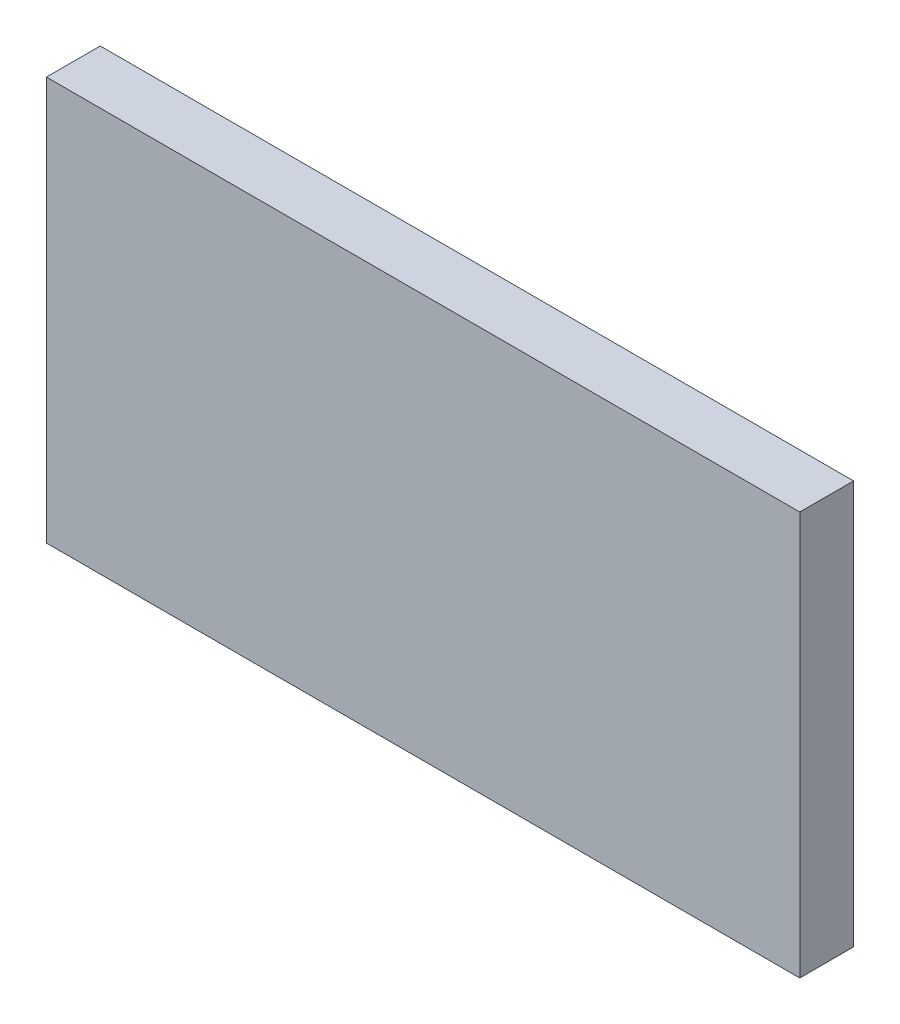
ISO-10303-21;
HEADER;
FILE_DESCRIPTION(('STEP AP214'),'2;1');
FILE_NAME('part.step','',(''),(''),'','','');
FILE_SCHEMA(('AUTOMOTIVE_DESIGN { 1 0 10303 214 1 1 1 1 }'));
ENDSEC;
DATA;
#1=APPLICATION_CONTEXT('core data for automotive mechanical design processes');
#2=APPLICATION_PROTOCOL_DEFINITION('international standard','automotive_design',2000,#1);
#3=PRODUCT_CONTEXT('',#1,'mechanical');
#4=PRODUCT('Part','Part','',(#3));
#5=PRODUCT_RELATED_PRODUCT_CATEGORY('part','',(#4));
#6=PRODUCT_DEFINITION_FORMATION('','',#4);
#7=PRODUCT_DEFINITION_CONTEXT('part definition',#1,'design');
#8=PRODUCT_DEFINITION('design','',#6,#7);
#9=PRODUCT_DEFINITION_SHAPE('','',#8);
#10=(LENGTH_UNIT() NAMED_UNIT(*) SI_UNIT(.MILLI.,.METRE.));
#11=(NAMED_UNIT(*) PLANE_ANGLE_UNIT() SI_UNIT($,.RADIAN.));
#12=(NAMED_UNIT(*) SI_UNIT($,.STERADIAN.) SOLID_ANGLE_UNIT());
#13=UNCERTAINTY_MEASURE_WITH_UNIT(LENGTH_MEASURE(1.E-05),#10,'distance_accuracy_value','');
#14=(GEOMETRIC_REPRESENTATION_CONTEXT(3) GLOBAL_UNCERTAINTY_ASSIGNED_CONTEXT((#13)) GLOBAL_UNIT_ASSIGNED_CONTEXT((#10,
#11,#12)) REPRESENTATION_CONTEXT('',''));
#15=CARTESIAN_POINT('',(0.,0.,0.));
#16=DIRECTION('',(0.,0.,1.));
#17=DIRECTION('',(1.,0.,0.));
#18=AXIS2_PLACEMENT_3D('',#15,#16,#17);
#19=CARTESIAN_POINT('',(-166.584362139918,89.7478991596639,20.));
#20=DIRECTION('',(1.,0.,0.));
#21=DIRECTION('',(0.,1.,0.));
#22=AXIS2_PLACEMENT_3D('',#19,#20,#21);
#23=PLANE('',#22);
#24=DIRECTION('',(0.,-1.,0.));
#25=VECTOR('',#24,1.);
#26=CARTESIAN_POINT('',(-166.584362139918,89.7478991596639,0.));
#27=LINE('',#26,#25);
#28=CARTESIAN_POINT('',(-166.584362139918,89.7478991596639,0.));
#29=VERTEX_POINT('',#28);
#30=CARTESIAN_POINT('',(-166.584362139918,-60.2521008403361,0.));
#31=VERTEX_POINT('',#30);
#32=EDGE_CURVE('E96',#29,#31,#27,.T.);
#33=ORIENTED_EDGE('',*,*,#32,.T.);
#34=DIRECTION('',(0.,0.,-1.));
#35=VECTOR('',#34,1.);
#36=CARTESIAN_POINT('',(-166.584362139918,-60.2521008403361,20.));
#37=LINE('',#36,#35);
#38=CARTESIAN_POINT('',(-166.584362139918,-60.2521008403361,20.));
#39=VERTEX_POINT('',#38);
#40=EDGE_CURVE('E11',#39,#31,#37,.T.);
#41=ORIENTED_EDGE('',*,*,#40,.F.);
#42=DIRECTION('',(0.,-1.,0.));
#43=VECTOR('',#42,1.);
#44=CARTESIAN_POINT('',(-166.584362139918,89.7478991596639,20.));
#45=LINE('',#44,#43);
#46=CARTESIAN_POINT('',(-166.584362139918,89.7478991596639,20.));
#47=VERTEX_POINT('',#46);
#48=EDGE_CURVE('E84',#47,#39,#45,.T.);
#49=ORIENTED_EDGE('',*,*,#48,.F.);
#50=DIRECTION('',(0.,0.,-1.));
#51=VECTOR('',#50,1.);
#52=CARTESIAN_POINT('',(-166.584362139918,89.7478991596639,20.));
#53=LINE('',#52,#51);
#54=EDGE_CURVE('E92',#47,#29,#53,.T.);
#55=ORIENTED_EDGE('',*,*,#54,.T.);
#56=EDGE_LOOP('',(#33,#41,#49,#55));
#57=FACE_BOUND('',#56,.T.);
#58=ADVANCED_FACE('F33',(#57),#23,.F.);
#59=CARTESIAN_POINT('',(-166.584362139918,-60.2521008403361,20.));
#60=DIRECTION('',(0.,1.,0.));
#61=DIRECTION('',(0.,0.,1.));
#62=AXIS2_PLACEMENT_3D('',#59,#60,#61);
#63=PLANE('',#62);
#64=DIRECTION('',(1.,0.,0.));
#65=VECTOR('',#64,1.);
#66=CARTESIAN_POINT('',(-166.584362139918,-60.2521008403361,0.));
#67=LINE('',#66,#65);
#68=CARTESIAN_POINT('',(113.415637860082,-60.2521008403361,0.));
#69=VERTEX_POINT('',#68);
#70=EDGE_CURVE('E88',#31,#69,#67,.T.);
#71=ORIENTED_EDGE('',*,*,#70,.T.);
#72=DIRECTION('',(0.,0.,-1.));
#73=VECTOR('',#72,1.);
#74=CARTESIAN_POINT('',(113.415637860082,-60.2521008403361,20.));
#75=LINE('',#74,#73);
#76=CARTESIAN_POINT('',(113.415637860082,-60.2521008403361,20.));
#77=VERTEX_POINT('',#76);
#78=EDGE_CURVE('E41',#77,#69,#75,.T.);
#79=ORIENTED_EDGE('',*,*,#78,.F.);
#80=DIRECTION('',(1.,0.,0.));
#81=VECTOR('',#80,1.);
#82=CARTESIAN_POINT('',(-166.584362139918,-60.2521008403361,20.));
#83=LINE('',#82,#81);
#84=EDGE_CURVE('E79',#39,#77,#83,.T.);
#85=ORIENTED_EDGE('',*,*,#84,.F.);
#86=ORIENTED_EDGE('',*,*,#40,.T.);
#87=EDGE_LOOP('',(#71,#79,#85,#86));
#88=FACE_BOUND('',#87,.T.);
#89=ADVANCED_FACE('F87',(#88),#63,.F.);
#90=CARTESIAN_POINT('',(113.415637860082,89.7478991596639,20.));
#91=DIRECTION('',(-1.,0.,0.));
#92=DIRECTION('',(0.,-1.,0.));
#93=AXIS2_PLACEMENT_3D('',#90,#91,#92);
#94=PLANE('',#93);
#95=DIRECTION('',(0.,1.,0.));
#96=VECTOR('',#95,1.);
#97=CARTESIAN_POINT('',(113.415637860082,89.7478991596639,0.));
#98=LINE('',#97,#96);
#99=CARTESIAN_POINT('',(113.415637860082,89.7478991596639,0.));
#100=VERTEX_POINT('',#99);
#101=EDGE_CURVE('E66',#69,#100,#98,.T.);
#102=ORIENTED_EDGE('',*,*,#101,.T.);
#103=DIRECTION('',(0.,0.,-1.));
#104=VECTOR('',#103,1.);
#105=CARTESIAN_POINT('',(113.415637860082,89.7478991596639,20.));
#106=LINE('',#105,#104);
#107=CARTESIAN_POINT('',(113.415637860082,89.7478991596639,20.));
#108=VERTEX_POINT('',#107);
#109=EDGE_CURVE('E89',#108,#100,#106,.T.);
#110=ORIENTED_EDGE('',*,*,#109,.F.);
#111=DIRECTION('',(0.,1.,0.));
#112=VECTOR('',#111,1.);
#113=CARTESIAN_POINT('',(113.415637860082,89.7478991596639,20.));
#114=LINE('',#113,#112);
#115=EDGE_CURVE('E82',#77,#108,#114,.T.);
#116=ORIENTED_EDGE('',*,*,#115,.F.);
#117=ORIENTED_EDGE('',*,*,#78,.T.);
#118=EDGE_LOOP('',(#102,#110,#116,#117));
#119=FACE_BOUND('',#118,.T.);
#120=ADVANCED_FACE('F90',(#119),#94,.F.);
#121=CARTESIAN_POINT('',(-166.584362139918,89.7478991596639,20.));
#122=DIRECTION('',(0.,-1.,0.));
#123=DIRECTION('',(0.,0.,-1.));
#124=AXIS2_PLACEMENT_3D('',#121,#122,#123);
#125=PLANE('',#124);
#126=DIRECTION('',(-1.,0.,0.));
#127=VECTOR('',#126,1.);
#128=CARTESIAN_POINT('',(-166.584362139918,89.7478991596639,0.));
#129=LINE('',#128,#127);
#130=EDGE_CURVE('E72',#100,#29,#129,.T.);
#131=ORIENTED_EDGE('',*,*,#130,.T.);
#132=ORIENTED_EDGE('',*,*,#54,.F.);
#133=DIRECTION('',(-1.,0.,0.));
#134=VECTOR('',#133,1.);
#135=CARTESIAN_POINT('',(-166.584362139918,89.7478991596639,20.));
#136=LINE('',#135,#134);
#137=EDGE_CURVE('E49',#108,#47,#136,.T.);
#138=ORIENTED_EDGE('',*,*,#137,.F.);
#139=ORIENTED_EDGE('',*,*,#109,.T.);
#140=EDGE_LOOP('',(#131,#132,#138,#139));
#141=FACE_BOUND('',#140,.T.);
#142=ADVANCED_FACE('F103',(#141),#125,.F.);
#143=CARTESIAN_POINT('',(0.,0.,20.));
#144=DIRECTION('',(0.,0.,1.));
#145=DIRECTION('',(1.,0.,0.));
#146=AXIS2_PLACEMENT_3D('',#143,#144,#145);
#147=PLANE('',#146);
#148=ORIENTED_EDGE('',*,*,#48,.T.);
#149=ORIENTED_EDGE('',*,*,#84,.T.);
#150=ORIENTED_EDGE('',*,*,#115,.T.);
#151=ORIENTED_EDGE('',*,*,#137,.T.);
#152=EDGE_LOOP('',(#148,#149,#150,#151));
#153=FACE_BOUND('',#152,.T.);
#154=ADVANCED_FACE('F80',(#153),#147,.T.);
#155=CARTESIAN_POINT('',(0.,0.,0.));
#156=DIRECTION('',(0.,0.,1.));
#157=DIRECTION('',(1.,0.,0.));
#158=AXIS2_PLACEMENT_3D('',#155,#156,#157);
#159=PLANE('',#158);
#160=ORIENTED_EDGE('',*,*,#32,.F.);
#161=ORIENTED_EDGE('',*,*,#130,.F.);
#162=ORIENTED_EDGE('',*,*,#101,.F.);
#163=ORIENTED_EDGE('',*,*,#70,.F.);
#164=EDGE_LOOP('',(#160,#161,#162,#163));
#165=FACE_BOUND('',#164,.T.);
#166=ADVANCED_FACE('F106',(#165),#159,.F.);
#167=CLOSED_SHELL('',(#58,#89,#120,#142,#154,#166));
#168=MANIFOLD_SOLID_BREP('B2',#167);
#169=ADVANCED_BREP_SHAPE_REPRESENTATION('',(#18,#168),#14);
#170=SHAPE_DEFINITION_REPRESENTATION(#9,#169);
ENDSEC;
END-ISO-10303-21;
